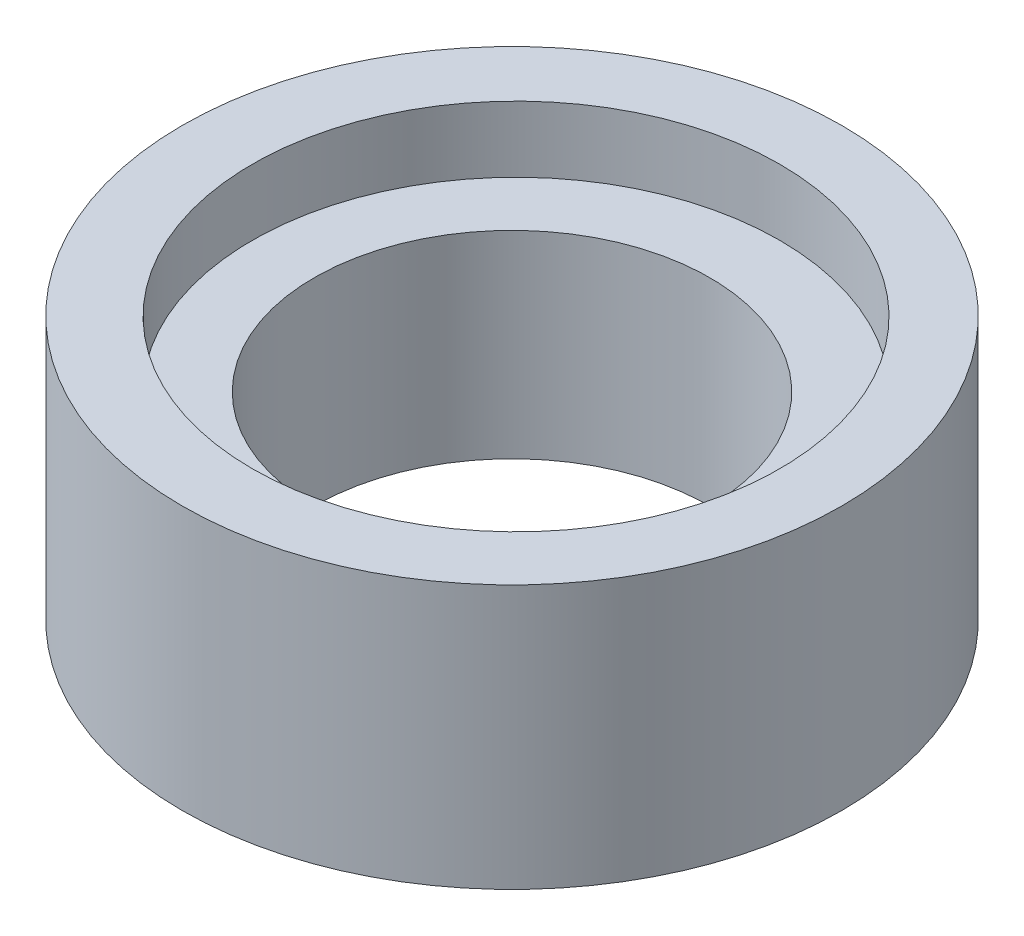
ISO-10303-21;
HEADER;
FILE_DESCRIPTION(('STEP AP214'),'2;1');
FILE_NAME('part.step','',(''),(''),'','','');
FILE_SCHEMA(('AUTOMOTIVE_DESIGN { 1 0 10303 214 1 1 1 1 }'));
ENDSEC;
DATA;
#1=APPLICATION_CONTEXT('core data for automotive mechanical design processes');
#2=APPLICATION_PROTOCOL_DEFINITION('international standard','automotive_design',2000,#1);
#3=PRODUCT_CONTEXT('',#1,'mechanical');
#4=PRODUCT('Part','Part','',(#3));
#5=PRODUCT_RELATED_PRODUCT_CATEGORY('part','',(#4));
#6=PRODUCT_DEFINITION_FORMATION('','',#4);
#7=PRODUCT_DEFINITION_CONTEXT('part definition',#1,'design');
#8=PRODUCT_DEFINITION('design','',#6,#7);
#9=PRODUCT_DEFINITION_SHAPE('','',#8);
#10=(LENGTH_UNIT() NAMED_UNIT(*) SI_UNIT(.MILLI.,.METRE.));
#11=(NAMED_UNIT(*) PLANE_ANGLE_UNIT() SI_UNIT($,.RADIAN.));
#12=(NAMED_UNIT(*) SI_UNIT($,.STERADIAN.) SOLID_ANGLE_UNIT());
#13=UNCERTAINTY_MEASURE_WITH_UNIT(LENGTH_MEASURE(1.E-05),#10,'distance_accuracy_value','');
#14=(GEOMETRIC_REPRESENTATION_CONTEXT(3) GLOBAL_UNCERTAINTY_ASSIGNED_CONTEXT((#13)) GLOBAL_UNIT_ASSIGNED_CONTEXT((#10,
#11,#12)) REPRESENTATION_CONTEXT('',''));
#15=CARTESIAN_POINT('',(0.,0.,0.));
#16=DIRECTION('',(0.,0.,1.));
#17=DIRECTION('',(1.,0.,0.));
#18=AXIS2_PLACEMENT_3D('',#15,#16,#17);
#19=CARTESIAN_POINT('',(0.,20.,0.));
#20=DIRECTION('',(0.,-1.,0.));
#21=DIRECTION('',(0.,0.,-1.));
#22=AXIS2_PLACEMENT_3D('',#19,#20,#21);
#23=CYLINDRICAL_SURFACE('',#22,25.);
#24=CARTESIAN_POINT('',(0.,20.,0.));
#25=DIRECTION('',(0.,1.,0.));
#26=DIRECTION('',(0.,0.,1.));
#27=AXIS2_PLACEMENT_3D('',#24,#25,#26);
#28=CIRCLE('',#27,25.);
#29=CARTESIAN_POINT('',(0.,20.,25.));
#30=VERTEX_POINT('',#29);
#31=EDGE_CURVE('E10',#30,#30,#28,.T.);
#32=ORIENTED_EDGE('',*,*,#31,.F.);
#33=EDGE_LOOP('',(#32));
#34=FACE_BOUND('',#33,.T.);
#35=CARTESIAN_POINT('',(0.,0.,0.));
#36=DIRECTION('',(0.,1.,0.));
#37=DIRECTION('',(0.,0.,1.));
#38=AXIS2_PLACEMENT_3D('',#35,#36,#37);
#39=CIRCLE('',#38,25.);
#40=CARTESIAN_POINT('',(0.,0.,25.));
#41=VERTEX_POINT('',#40);
#42=EDGE_CURVE('E38',#41,#41,#39,.T.);
#43=ORIENTED_EDGE('',*,*,#42,.T.);
#44=EDGE_LOOP('',(#43));
#45=FACE_BOUND('',#44,.T.);
#46=ADVANCED_FACE('F31',(#34,#45),#23,.T.);
#47=CARTESIAN_POINT('',(0.,20.,0.));
#48=DIRECTION('',(0.,1.,0.));
#49=DIRECTION('',(0.,0.,1.));
#50=AXIS2_PLACEMENT_3D('',#47,#48,#49);
#51=PLANE('',#50);
#52=CARTESIAN_POINT('',(0.202413873565483,20.,-0.10440236516214));
#53=DIRECTION('',(0.,1.,0.));
#54=DIRECTION('',(0.,0.,1.));
#55=AXIS2_PLACEMENT_3D('',#52,#53,#54);
#56=CIRCLE('',#55,20.);
#57=CARTESIAN_POINT('',(0.202413873565483,20.,19.8955976348379));
#58=VERTEX_POINT('',#57);
#59=EDGE_CURVE('E43',#58,#58,#56,.F.);
#60=ORIENTED_EDGE('',*,*,#59,.T.);
#61=EDGE_LOOP('',(#60));
#62=FACE_BOUND('',#61,.T.);
#63=ORIENTED_EDGE('',*,*,#31,.T.);
#64=EDGE_LOOP('',(#63));
#65=FACE_BOUND('',#64,.T.);
#66=ADVANCED_FACE('F77',(#62,#65),#51,.T.);
#67=CARTESIAN_POINT('',(0.,0.,0.));
#68=DIRECTION('',(0.,1.,0.));
#69=DIRECTION('',(0.,0.,1.));
#70=AXIS2_PLACEMENT_3D('',#67,#68,#69);
#71=PLANE('',#70);
#72=CARTESIAN_POINT('',(0.,0.,0.));
#73=DIRECTION('',(0.,1.,0.));
#74=DIRECTION('',(0.,0.,1.));
#75=AXIS2_PLACEMENT_3D('',#72,#73,#74);
#76=CIRCLE('',#75,15.);
#77=CARTESIAN_POINT('',(0.,0.,15.));
#78=VERTEX_POINT('',#77);
#79=EDGE_CURVE('E34',#78,#78,#76,.T.);
#80=ORIENTED_EDGE('',*,*,#79,.T.);
#81=EDGE_LOOP('',(#80));
#82=FACE_BOUND('',#81,.T.);
#83=ORIENTED_EDGE('',*,*,#42,.F.);
#84=EDGE_LOOP('',(#83));
#85=FACE_BOUND('',#84,.T.);
#86=ADVANCED_FACE('F73',(#82,#85),#71,.F.);
#87=CARTESIAN_POINT('',(0.202413873565483,21.,-0.10440236516214));
#88=DIRECTION('',(0.,-1.,0.));
#89=DIRECTION('',(0.,0.,-1.));
#90=AXIS2_PLACEMENT_3D('',#87,#88,#89);
#91=CYLINDRICAL_SURFACE('',#90,20.);
#92=ORIENTED_EDGE('',*,*,#59,.F.);
#93=EDGE_LOOP('',(#92));
#94=FACE_BOUND('',#93,.T.);
#95=CARTESIAN_POINT('',(0.202413873565483,15.,-0.10440236516214));
#96=DIRECTION('',(0.,1.,0.));
#97=DIRECTION('',(0.,0.,1.));
#98=AXIS2_PLACEMENT_3D('',#95,#96,#97);
#99=CIRCLE('',#98,20.);
#100=CARTESIAN_POINT('',(0.202413873565483,15.,19.8955976348379));
#101=VERTEX_POINT('',#100);
#102=EDGE_CURVE('E46',#101,#101,#99,.T.);
#103=ORIENTED_EDGE('',*,*,#102,.F.);
#104=EDGE_LOOP('',(#103));
#105=FACE_BOUND('',#104,.T.);
#106=ADVANCED_FACE('F66',(#94,#105),#91,.F.);
#107=CARTESIAN_POINT('',(0.202413873565483,15.,-0.10440236516214));
#108=DIRECTION('',(0.,1.,0.));
#109=DIRECTION('',(0.,0.,1.));
#110=AXIS2_PLACEMENT_3D('',#107,#108,#109);
#111=PLANE('',#110);
#112=CARTESIAN_POINT('',(0.,15.,0.));
#113=DIRECTION('',(0.,1.,0.));
#114=DIRECTION('',(0.,0.,1.));
#115=AXIS2_PLACEMENT_3D('',#112,#113,#114);
#116=CIRCLE('',#115,15.);
#117=CARTESIAN_POINT('',(0.,15.,15.));
#118=VERTEX_POINT('',#117);
#119=EDGE_CURVE('E55',#118,#118,#116,.T.);
#120=ORIENTED_EDGE('',*,*,#119,.F.);
#121=EDGE_LOOP('',(#120));
#122=FACE_BOUND('',#121,.T.);
#123=ORIENTED_EDGE('',*,*,#102,.T.);
#124=EDGE_LOOP('',(#123));
#125=FACE_BOUND('',#124,.T.);
#126=ADVANCED_FACE('F64',(#122,#125),#111,.T.);
#127=CARTESIAN_POINT('',(0.,-14.,0.));
#128=DIRECTION('',(0.,1.,0.));
#129=DIRECTION('',(0.,0.,1.));
#130=AXIS2_PLACEMENT_3D('',#127,#128,#129);
#131=CYLINDRICAL_SURFACE('',#130,15.);
#132=ORIENTED_EDGE('',*,*,#119,.T.);
#133=EDGE_LOOP('',(#132));
#134=FACE_BOUND('',#133,.T.);
#135=ORIENTED_EDGE('',*,*,#79,.F.);
#136=EDGE_LOOP('',(#135));
#137=FACE_BOUND('',#136,.T.);
#138=ADVANCED_FACE('F61',(#134,#137),#131,.F.);
#139=CLOSED_SHELL('',(#46,#66,#86,#106,#126,#138));
#140=MANIFOLD_SOLID_BREP('B2',#139);
#141=ADVANCED_BREP_SHAPE_REPRESENTATION('',(#18,#140),#14);
#142=SHAPE_DEFINITION_REPRESENTATION(#9,#141);
ENDSEC;
END-ISO-10303-21;
